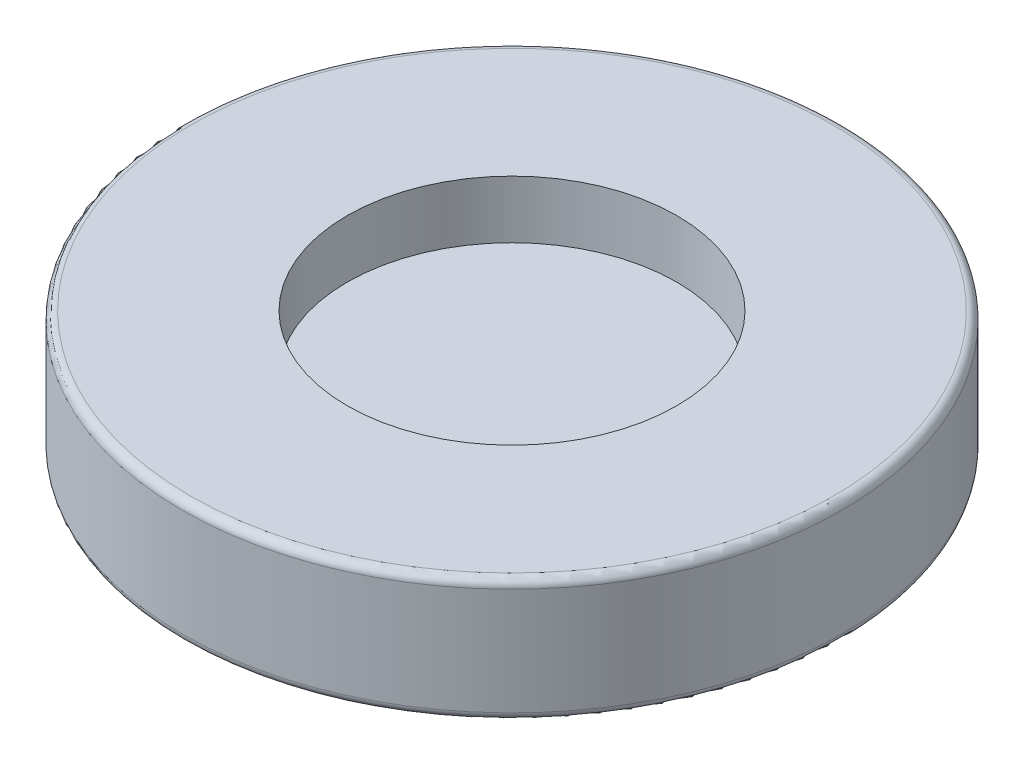
ISO-10303-21;
HEADER;
FILE_DESCRIPTION(('STEP AP214'),'2;1');
FILE_NAME('part.step','',(''),(''),'','','');
FILE_SCHEMA(('AUTOMOTIVE_DESIGN { 1 0 10303 214 1 1 1 1 }'));
ENDSEC;
DATA;
#1=APPLICATION_CONTEXT('core data for automotive mechanical design processes');
#2=APPLICATION_PROTOCOL_DEFINITION('international standard','automotive_design',2000,#1);
#3=PRODUCT_CONTEXT('',#1,'mechanical');
#4=PRODUCT('Part','Part','',(#3));
#5=PRODUCT_RELATED_PRODUCT_CATEGORY('part','',(#4));
#6=PRODUCT_DEFINITION_FORMATION('','',#4);
#7=PRODUCT_DEFINITION_CONTEXT('part definition',#1,'design');
#8=PRODUCT_DEFINITION('design','',#6,#7);
#9=PRODUCT_DEFINITION_SHAPE('','',#8);
#10=(LENGTH_UNIT() NAMED_UNIT(*) SI_UNIT(.MILLI.,.METRE.));
#11=(NAMED_UNIT(*) PLANE_ANGLE_UNIT() SI_UNIT($,.RADIAN.));
#12=(NAMED_UNIT(*) SI_UNIT($,.STERADIAN.) SOLID_ANGLE_UNIT());
#13=UNCERTAINTY_MEASURE_WITH_UNIT(LENGTH_MEASURE(1.E-05),#10,'distance_accuracy_value','');
#14=(GEOMETRIC_REPRESENTATION_CONTEXT(3) GLOBAL_UNCERTAINTY_ASSIGNED_CONTEXT((#13)) GLOBAL_UNIT_ASSIGNED_CONTEXT((#10,
#11,#12)) REPRESENTATION_CONTEXT('',''));
#15=CARTESIAN_POINT('',(0.,0.,0.));
#16=DIRECTION('',(0.,0.,1.));
#17=DIRECTION('',(1.,0.,0.));
#18=AXIS2_PLACEMENT_3D('',#15,#16,#17);
#19=CARTESIAN_POINT('',(0.,1.5,0.));
#20=DIRECTION('',(0.,-1.,0.));
#21=DIRECTION('',(0.,0.,-1.));
#22=AXIS2_PLACEMENT_3D('',#19,#20,#21);
#23=CYLINDRICAL_SURFACE('',#22,4.);
#24=CARTESIAN_POINT('',(0.,1.4,0.));
#25=DIRECTION('',(0.,1.,0.));
#26=DIRECTION('',(0.,0.,1.));
#27=AXIS2_PLACEMENT_3D('',#24,#25,#26);
#28=CIRCLE('',#27,4.);
#29=CARTESIAN_POINT('',(0.,1.4,4.));
#30=VERTEX_POINT('',#29);
#31=EDGE_CURVE('E10',#30,#30,#28,.F.);
#32=ORIENTED_EDGE('',*,*,#31,.T.);
#33=EDGE_LOOP('',(#32));
#34=FACE_BOUND('',#33,.T.);
#35=CARTESIAN_POINT('',(0.,0.1,0.));
#36=DIRECTION('',(0.,1.,0.));
#37=DIRECTION('',(0.,0.,1.));
#38=AXIS2_PLACEMENT_3D('',#35,#36,#37);
#39=CIRCLE('',#38,4.);
#40=CARTESIAN_POINT('',(0.,0.1,4.));
#41=VERTEX_POINT('',#40);
#42=EDGE_CURVE('E55',#41,#41,#39,.T.);
#43=ORIENTED_EDGE('',*,*,#42,.T.);
#44=EDGE_LOOP('',(#43));
#45=FACE_BOUND('',#44,.T.);
#46=ADVANCED_FACE('F37',(#34,#45),#23,.T.);
#47=CARTESIAN_POINT('',(0.,1.5,0.));
#48=DIRECTION('',(0.,1.,0.));
#49=DIRECTION('',(0.,0.,1.));
#50=AXIS2_PLACEMENT_3D('',#47,#48,#49);
#51=PLANE('',#50);
#52=CARTESIAN_POINT('',(0.,1.5,0.));
#53=DIRECTION('',(0.,1.,0.));
#54=DIRECTION('',(0.,0.,1.));
#55=AXIS2_PLACEMENT_3D('',#52,#53,#54);
#56=CIRCLE('',#55,3.9);
#57=CARTESIAN_POINT('',(0.,1.5,3.9));
#58=VERTEX_POINT('',#57);
#59=EDGE_CURVE('E45',#58,#58,#56,.T.);
#60=ORIENTED_EDGE('',*,*,#59,.T.);
#61=EDGE_LOOP('',(#60));
#62=FACE_BOUND('',#61,.T.);
#63=CARTESIAN_POINT('',(0.,1.5,0.));
#64=DIRECTION('',(0.,1.,0.));
#65=DIRECTION('',(0.,0.,1.));
#66=AXIS2_PLACEMENT_3D('',#63,#64,#65);
#67=CIRCLE('',#66,2.);
#68=CARTESIAN_POINT('',(0.,1.5,2.));
#69=VERTEX_POINT('',#68);
#70=EDGE_CURVE('E62',#69,#69,#67,.T.);
#71=ORIENTED_EDGE('',*,*,#70,.F.);
#72=EDGE_LOOP('',(#71));
#73=FACE_BOUND('',#72,.T.);
#74=ADVANCED_FACE('F79',(#62,#73),#51,.T.);
#75=CARTESIAN_POINT('',(0.,0.,0.));
#76=DIRECTION('',(0.,1.,0.));
#77=DIRECTION('',(0.,0.,1.));
#78=AXIS2_PLACEMENT_3D('',#75,#76,#77);
#79=PLANE('',#78);
#80=CARTESIAN_POINT('',(0.,0.,0.));
#81=DIRECTION('',(0.,1.,0.));
#82=DIRECTION('',(0.,0.,1.));
#83=AXIS2_PLACEMENT_3D('',#80,#81,#82);
#84=CIRCLE('',#83,3.9);
#85=CARTESIAN_POINT('',(0.,0.,3.9));
#86=VERTEX_POINT('',#85);
#87=EDGE_CURVE('E50',#86,#86,#84,.F.);
#88=ORIENTED_EDGE('',*,*,#87,.T.);
#89=EDGE_LOOP('',(#88));
#90=FACE_BOUND('',#89,.T.);
#91=ADVANCED_FACE('F75',(#90),#79,.F.);
#92=CARTESIAN_POINT('',(0.,0.8,0.));
#93=DIRECTION('',(0.,1.,0.));
#94=DIRECTION('',(0.,0.,1.));
#95=AXIS2_PLACEMENT_3D('',#92,#93,#94);
#96=CYLINDRICAL_SURFACE('',#95,2.);
#97=CARTESIAN_POINT('',(0.,0.8,0.));
#98=DIRECTION('',(0.,1.,0.));
#99=DIRECTION('',(0.,0.,1.));
#100=AXIS2_PLACEMENT_3D('',#97,#98,#99);
#101=CIRCLE('',#100,2.);
#102=CARTESIAN_POINT('',(0.,0.8,2.));
#103=VERTEX_POINT('',#102);
#104=EDGE_CURVE('E61',#103,#103,#101,.T.);
#105=ORIENTED_EDGE('',*,*,#104,.F.);
#106=EDGE_LOOP('',(#105));
#107=FACE_BOUND('',#106,.T.);
#108=ORIENTED_EDGE('',*,*,#70,.T.);
#109=EDGE_LOOP('',(#108));
#110=FACE_BOUND('',#109,.T.);
#111=ADVANCED_FACE('F72',(#107,#110),#96,.F.);
#112=CARTESIAN_POINT('',(0.,0.8,0.));
#113=DIRECTION('',(0.,1.,0.));
#114=DIRECTION('',(0.,0.,1.));
#115=AXIS2_PLACEMENT_3D('',#112,#113,#114);
#116=PLANE('',#115);
#117=ORIENTED_EDGE('',*,*,#104,.T.);
#118=EDGE_LOOP('',(#117));
#119=FACE_BOUND('',#118,.T.);
#120=ADVANCED_FACE('F70',(#119),#116,.T.);
#121=CARTESIAN_POINT('',(0.,0.1,0.));
#122=DIRECTION('',(0.,1.,0.));
#123=DIRECTION('',(0.,0.,1.));
#124=AXIS2_PLACEMENT_3D('',#121,#122,#123);
#125=TOROIDAL_SURFACE('',#124,3.9,0.1);
#126=ORIENTED_EDGE('',*,*,#87,.F.);
#127=EDGE_LOOP('',(#126));
#128=FACE_BOUND('',#127,.T.);
#129=ORIENTED_EDGE('',*,*,#42,.F.);
#130=EDGE_LOOP('',(#129));
#131=FACE_BOUND('',#130,.T.);
#132=ADVANCED_FACE('F90',(#128,#131),#125,.T.);
#133=CARTESIAN_POINT('',(0.,1.4,0.));
#134=DIRECTION('',(0.,1.,0.));
#135=DIRECTION('',(0.,0.,1.));
#136=AXIS2_PLACEMENT_3D('',#133,#134,#135);
#137=TOROIDAL_SURFACE('',#136,3.9,0.1);
#138=ORIENTED_EDGE('',*,*,#31,.F.);
#139=EDGE_LOOP('',(#138));
#140=FACE_BOUND('',#139,.T.);
#141=ORIENTED_EDGE('',*,*,#59,.F.);
#142=EDGE_LOOP('',(#141));
#143=FACE_BOUND('',#142,.T.);
#144=ADVANCED_FACE('F39',(#140,#143),#137,.T.);
#145=CLOSED_SHELL('',(#46,#74,#91,#111,#120,#132,#144));
#146=MANIFOLD_SOLID_BREP('B2',#145);
#147=ADVANCED_BREP_SHAPE_REPRESENTATION('',(#18,#146),#14);
#148=SHAPE_DEFINITION_REPRESENTATION(#9,#147);
ENDSEC;
END-ISO-10303-21;
